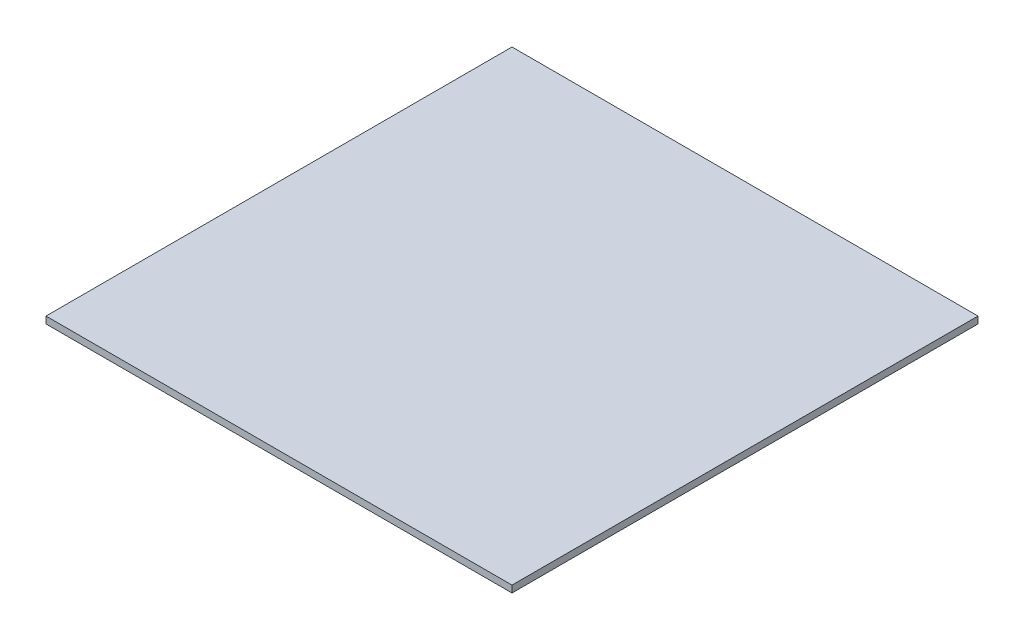
ISO-10303-21;
HEADER;
FILE_DESCRIPTION(('STEP AP214'),'2;1');
FILE_NAME('part.step','',(''),(''),'','','');
FILE_SCHEMA(('AUTOMOTIVE_DESIGN { 1 0 10303 214 1 1 1 1 }'));
ENDSEC;
DATA;
#1=APPLICATION_CONTEXT('core data for automotive mechanical design processes');
#2=APPLICATION_PROTOCOL_DEFINITION('international standard','automotive_design',2000,#1);
#3=PRODUCT_CONTEXT('',#1,'mechanical');
#4=PRODUCT('Part','Part','',(#3));
#5=PRODUCT_RELATED_PRODUCT_CATEGORY('part','',(#4));
#6=PRODUCT_DEFINITION_FORMATION('','',#4);
#7=PRODUCT_DEFINITION_CONTEXT('part definition',#1,'design');
#8=PRODUCT_DEFINITION('design','',#6,#7);
#9=PRODUCT_DEFINITION_SHAPE('','',#8);
#10=(LENGTH_UNIT() NAMED_UNIT(*) SI_UNIT(.MILLI.,.METRE.));
#11=(NAMED_UNIT(*) PLANE_ANGLE_UNIT() SI_UNIT($,.RADIAN.));
#12=(NAMED_UNIT(*) SI_UNIT($,.STERADIAN.) SOLID_ANGLE_UNIT());
#13=UNCERTAINTY_MEASURE_WITH_UNIT(LENGTH_MEASURE(1.E-05),#10,'distance_accuracy_value','');
#14=(GEOMETRIC_REPRESENTATION_CONTEXT(3) GLOBAL_UNCERTAINTY_ASSIGNED_CONTEXT((#13)) GLOBAL_UNIT_ASSIGNED_CONTEXT((#10,
#11,#12)) REPRESENTATION_CONTEXT('',''));
#15=CARTESIAN_POINT('',(0.,0.,0.));
#16=DIRECTION('',(0.,0.,1.));
#17=DIRECTION('',(1.,0.,0.));
#18=AXIS2_PLACEMENT_3D('',#15,#16,#17);
#19=CARTESIAN_POINT('',(-107.705,3.175,107.705));
#20=DIRECTION('',(1.,0.,0.));
#21=DIRECTION('',(0.,0.,-1.));
#22=AXIS2_PLACEMENT_3D('',#19,#20,#21);
#23=PLANE('',#22);
#24=DIRECTION('',(0.,0.,1.));
#25=VECTOR('',#24,1.);
#26=CARTESIAN_POINT('',(-107.705,0.,107.705));
#27=LINE('',#26,#25);
#28=CARTESIAN_POINT('',(-107.705,0.,-107.705));
#29=VERTEX_POINT('',#28);
#30=CARTESIAN_POINT('',(-107.705,0.,107.705));
#31=VERTEX_POINT('',#30);
#32=EDGE_CURVE('E106',#29,#31,#27,.T.);
#33=ORIENTED_EDGE('',*,*,#32,.T.);
#34=DIRECTION('',(0.,-1.,0.));
#35=VECTOR('',#34,1.);
#36=CARTESIAN_POINT('',(-107.705,3.175,107.705));
#37=LINE('',#36,#35);
#38=CARTESIAN_POINT('',(-107.705,3.175,107.705));
#39=VERTEX_POINT('',#38);
#40=EDGE_CURVE('E11',#39,#31,#37,.T.);
#41=ORIENTED_EDGE('',*,*,#40,.F.);
#42=DIRECTION('',(0.,0.,1.));
#43=VECTOR('',#42,1.);
#44=CARTESIAN_POINT('',(-107.705,3.175,107.705));
#45=LINE('',#44,#43);
#46=CARTESIAN_POINT('',(-107.705,3.175,-107.705));
#47=VERTEX_POINT('',#46);
#48=EDGE_CURVE('E94',#47,#39,#45,.T.);
#49=ORIENTED_EDGE('',*,*,#48,.F.);
#50=DIRECTION('',(0.,-1.,0.));
#51=VECTOR('',#50,1.);
#52=CARTESIAN_POINT('',(-107.705,3.175,-107.705));
#53=LINE('',#52,#51);
#54=EDGE_CURVE('E102',#47,#29,#53,.T.);
#55=ORIENTED_EDGE('',*,*,#54,.T.);
#56=EDGE_LOOP('',(#33,#41,#49,#55));
#57=FACE_BOUND('',#56,.T.);
#58=ADVANCED_FACE('F43',(#57),#23,.F.);
#59=CARTESIAN_POINT('',(107.705,3.175,107.705));
#60=DIRECTION('',(0.,0.,-1.));
#61=DIRECTION('',(-1.,0.,0.));
#62=AXIS2_PLACEMENT_3D('',#59,#60,#61);
#63=PLANE('',#62);
#64=DIRECTION('',(1.,0.,0.));
#65=VECTOR('',#64,1.);
#66=CARTESIAN_POINT('',(107.705,0.,107.705));
#67=LINE('',#66,#65);
#68=CARTESIAN_POINT('',(107.705,0.,107.705));
#69=VERTEX_POINT('',#68);
#70=EDGE_CURVE('E98',#31,#69,#67,.T.);
#71=ORIENTED_EDGE('',*,*,#70,.T.);
#72=DIRECTION('',(0.,-1.,0.));
#73=VECTOR('',#72,1.);
#74=CARTESIAN_POINT('',(107.705,3.175,107.705));
#75=LINE('',#74,#73);
#76=CARTESIAN_POINT('',(107.705,3.175,107.705));
#77=VERTEX_POINT('',#76);
#78=EDGE_CURVE('E51',#77,#69,#75,.T.);
#79=ORIENTED_EDGE('',*,*,#78,.F.);
#80=DIRECTION('',(1.,0.,0.));
#81=VECTOR('',#80,1.);
#82=CARTESIAN_POINT('',(107.705,3.175,107.705));
#83=LINE('',#82,#81);
#84=EDGE_CURVE('E89',#39,#77,#83,.T.);
#85=ORIENTED_EDGE('',*,*,#84,.F.);
#86=ORIENTED_EDGE('',*,*,#40,.T.);
#87=EDGE_LOOP('',(#71,#79,#85,#86));
#88=FACE_BOUND('',#87,.T.);
#89=ADVANCED_FACE('F97',(#88),#63,.F.);
#90=CARTESIAN_POINT('',(107.705,3.175,107.705));
#91=DIRECTION('',(-1.,0.,0.));
#92=DIRECTION('',(0.,0.,1.));
#93=AXIS2_PLACEMENT_3D('',#90,#91,#92);
#94=PLANE('',#93);
#95=DIRECTION('',(0.,0.,-1.));
#96=VECTOR('',#95,1.);
#97=CARTESIAN_POINT('',(107.705,0.,107.705));
#98=LINE('',#97,#96);
#99=CARTESIAN_POINT('',(107.705,0.,-107.705));
#100=VERTEX_POINT('',#99);
#101=EDGE_CURVE('E76',#69,#100,#98,.T.);
#102=ORIENTED_EDGE('',*,*,#101,.T.);
#103=DIRECTION('',(0.,-1.,0.));
#104=VECTOR('',#103,1.);
#105=CARTESIAN_POINT('',(107.705,3.175,-107.705));
#106=LINE('',#105,#104);
#107=CARTESIAN_POINT('',(107.705,3.175,-107.705));
#108=VERTEX_POINT('',#107);
#109=EDGE_CURVE('E99',#108,#100,#106,.T.);
#110=ORIENTED_EDGE('',*,*,#109,.F.);
#111=DIRECTION('',(0.,0.,-1.));
#112=VECTOR('',#111,1.);
#113=CARTESIAN_POINT('',(107.705,3.175,107.705));
#114=LINE('',#113,#112);
#115=EDGE_CURVE('E92',#77,#108,#114,.T.);
#116=ORIENTED_EDGE('',*,*,#115,.F.);
#117=ORIENTED_EDGE('',*,*,#78,.T.);
#118=EDGE_LOOP('',(#102,#110,#116,#117));
#119=FACE_BOUND('',#118,.T.);
#120=ADVANCED_FACE('F100',(#119),#94,.F.);
#121=CARTESIAN_POINT('',(107.705,3.175,-107.705));
#122=DIRECTION('',(0.,0.,1.));
#123=DIRECTION('',(1.,0.,0.));
#124=AXIS2_PLACEMENT_3D('',#121,#122,#123);
#125=PLANE('',#124);
#126=DIRECTION('',(-1.,0.,0.));
#127=VECTOR('',#126,1.);
#128=CARTESIAN_POINT('',(107.705,0.,-107.705));
#129=LINE('',#128,#127);
#130=EDGE_CURVE('E82',#100,#29,#129,.T.);
#131=ORIENTED_EDGE('',*,*,#130,.T.);
#132=ORIENTED_EDGE('',*,*,#54,.F.);
#133=DIRECTION('',(-1.,0.,0.));
#134=VECTOR('',#133,1.);
#135=CARTESIAN_POINT('',(107.705,3.175,-107.705));
#136=LINE('',#135,#134);
#137=EDGE_CURVE('E59',#108,#47,#136,.T.);
#138=ORIENTED_EDGE('',*,*,#137,.F.);
#139=ORIENTED_EDGE('',*,*,#109,.T.);
#140=EDGE_LOOP('',(#131,#132,#138,#139));
#141=FACE_BOUND('',#140,.T.);
#142=ADVANCED_FACE('F113',(#141),#125,.F.);
#143=CARTESIAN_POINT('',(0.,3.175,0.));
#144=DIRECTION('',(0.,1.,0.));
#145=DIRECTION('',(0.,0.,1.));
#146=AXIS2_PLACEMENT_3D('',#143,#144,#145);
#147=PLANE('',#146);
#148=ORIENTED_EDGE('',*,*,#48,.T.);
#149=ORIENTED_EDGE('',*,*,#84,.T.);
#150=ORIENTED_EDGE('',*,*,#115,.T.);
#151=ORIENTED_EDGE('',*,*,#137,.T.);
#152=EDGE_LOOP('',(#148,#149,#150,#151));
#153=FACE_BOUND('',#152,.T.);
#154=ADVANCED_FACE('F90',(#153),#147,.T.);
#155=CARTESIAN_POINT('',(0.,0.,0.));
#156=DIRECTION('',(0.,1.,0.));
#157=DIRECTION('',(0.,0.,1.));
#158=AXIS2_PLACEMENT_3D('',#155,#156,#157);
#159=PLANE('',#158);
#160=ORIENTED_EDGE('',*,*,#32,.F.);
#161=ORIENTED_EDGE('',*,*,#130,.F.);
#162=ORIENTED_EDGE('',*,*,#101,.F.);
#163=ORIENTED_EDGE('',*,*,#70,.F.);
#164=EDGE_LOOP('',(#160,#161,#162,#163));
#165=FACE_BOUND('',#164,.T.);
#166=ADVANCED_FACE('F116',(#165),#159,.F.);
#167=CLOSED_SHELL('',(#58,#89,#120,#142,#154,#166));
#168=MANIFOLD_SOLID_BREP('B2',#167);
#169=ADVANCED_BREP_SHAPE_REPRESENTATION('',(#18,#168),#14);
#170=SHAPE_DEFINITION_REPRESENTATION(#9,#169);
ENDSEC;
END-ISO-10303-21;
